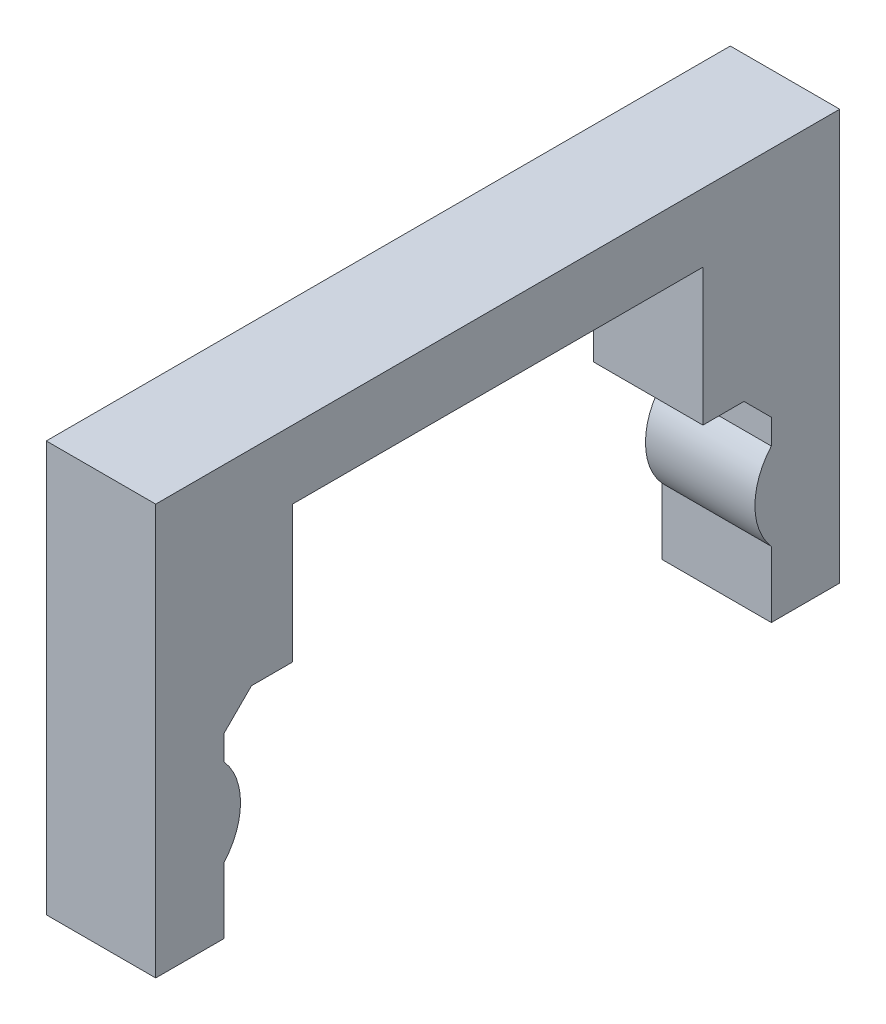
ISO-10303-21;
HEADER;
FILE_DESCRIPTION(('STEP AP214'),'2;1');
FILE_NAME('part.step','',(''),(''),'','','');
FILE_SCHEMA(('AUTOMOTIVE_DESIGN { 1 0 10303 214 1 1 1 1 }'));
ENDSEC;
DATA;
#1=APPLICATION_CONTEXT('core data for automotive mechanical design processes');
#2=APPLICATION_PROTOCOL_DEFINITION('international standard','automotive_design',2000,#1);
#3=PRODUCT_CONTEXT('',#1,'mechanical');
#4=PRODUCT('Part','Part','',(#3));
#5=PRODUCT_RELATED_PRODUCT_CATEGORY('part','',(#4));
#6=PRODUCT_DEFINITION_FORMATION('','',#4);
#7=PRODUCT_DEFINITION_CONTEXT('part definition',#1,'design');
#8=PRODUCT_DEFINITION('design','',#6,#7);
#9=PRODUCT_DEFINITION_SHAPE('','',#8);
#10=(LENGTH_UNIT() NAMED_UNIT(*) SI_UNIT(.MILLI.,.METRE.));
#11=(NAMED_UNIT(*) PLANE_ANGLE_UNIT() SI_UNIT($,.RADIAN.));
#12=(NAMED_UNIT(*) SI_UNIT($,.STERADIAN.) SOLID_ANGLE_UNIT());
#13=UNCERTAINTY_MEASURE_WITH_UNIT(LENGTH_MEASURE(1.E-05),#10,'distance_accuracy_value','');
#14=(GEOMETRIC_REPRESENTATION_CONTEXT(3) GLOBAL_UNCERTAINTY_ASSIGNED_CONTEXT((#13)) GLOBAL_UNIT_ASSIGNED_CONTEXT((#10,
#11,#12)) REPRESENTATION_CONTEXT('',''));
#15=CARTESIAN_POINT('',(0.,0.,0.));
#16=DIRECTION('',(0.,0.,1.));
#17=DIRECTION('',(1.,0.,0.));
#18=AXIS2_PLACEMENT_3D('',#15,#16,#17);
#19=CARTESIAN_POINT('',(10.16,9.94734725305141,44.6955776659082));
#20=DIRECTION('',(0.,0.,-1.));
#21=DIRECTION('',(-1.,0.,0.));
#22=AXIS2_PLACEMENT_3D('',#19,#20,#21);
#23=PLANE('',#22);
#24=DIRECTION('',(0.,-1.,0.));
#25=VECTOR('',#24,1.);
#26=CARTESIAN_POINT('',(10.16,9.94734725305141,44.6955776659082));
#27=LINE('',#26,#25);
#28=CARTESIAN_POINT('',(10.16,7.4073472530514,44.6955776659082));
#29=VERTEX_POINT('',#28);
#30=CARTESIAN_POINT('',(10.16,5.08947225111384,44.6955776659082));
#31=VERTEX_POINT('',#30);
#32=EDGE_CURVE('E157',#29,#31,#27,.T.);
#33=ORIENTED_EDGE('',*,*,#32,.F.);
#34=DIRECTION('',(-1.,0.,0.));
#35=VECTOR('',#34,1.);
#36=CARTESIAN_POINT('',(0.,7.4073472530514,44.6955776659082));
#37=LINE('',#36,#35);
#38=CARTESIAN_POINT('',(0.,7.4073472530514,44.6955776659082));
#39=VERTEX_POINT('',#38);
#40=EDGE_CURVE('E278',#29,#39,#37,.T.);
#41=ORIENTED_EDGE('',*,*,#40,.T.);
#42=DIRECTION('',(0.,-1.,0.));
#43=VECTOR('',#42,1.);
#44=CARTESIAN_POINT('',(0.,9.94734725305141,44.6955776659082));
#45=LINE('',#44,#43);
#46=CARTESIAN_POINT('',(0.,5.08947225111384,44.6955776659082));
#47=VERTEX_POINT('',#46);
#48=EDGE_CURVE('E180',#39,#47,#45,.T.);
#49=ORIENTED_EDGE('',*,*,#48,.T.);
#50=DIRECTION('',(1.,0.,0.));
#51=VECTOR('',#50,1.);
#52=CARTESIAN_POINT('',(0.,5.08947225111384,44.6955776659082));
#53=LINE('',#52,#51);
#54=EDGE_CURVE('E173',#47,#31,#53,.T.);
#55=ORIENTED_EDGE('',*,*,#54,.T.);
#56=EDGE_LOOP('',(#33,#41,#49,#55));
#57=FACE_BOUND('',#56,.T.);
#58=ADVANCED_FACE('F33',(#57),#23,.F.);
#59=CARTESIAN_POINT('',(10.16,-9.1026527469486,95.4955776659082));
#60=DIRECTION('',(0.,0.,1.));
#61=DIRECTION('',(1.,0.,0.));
#62=AXIS2_PLACEMENT_3D('',#59,#60,#61);
#63=PLANE('',#62);
#64=DIRECTION('',(0.,1.,0.));
#65=VECTOR('',#64,1.);
#66=CARTESIAN_POINT('',(0.,-9.1026527469486,95.4955776659082));
#67=LINE('',#66,#65);
#68=CARTESIAN_POINT('',(0.,-9.1026527469486,95.4955776659082));
#69=VERTEX_POINT('',#68);
#70=CARTESIAN_POINT('',(0.,-2.97477774501105,95.4955776659082));
#71=VERTEX_POINT('',#70);
#72=EDGE_CURVE('E224',#69,#71,#67,.T.);
#73=ORIENTED_EDGE('',*,*,#72,.T.);
#74=DIRECTION('',(1.,0.,0.));
#75=VECTOR('',#74,1.);
#76=CARTESIAN_POINT('',(0.,-2.97477774501105,95.4955776659082));
#77=LINE('',#76,#75);
#78=CARTESIAN_POINT('',(10.16,-2.97477774501105,95.4955776659082));
#79=VERTEX_POINT('',#78);
#80=EDGE_CURVE('E191',#71,#79,#77,.T.);
#81=ORIENTED_EDGE('',*,*,#80,.T.);
#82=DIRECTION('',(0.,1.,0.));
#83=VECTOR('',#82,1.);
#84=CARTESIAN_POINT('',(10.16,-9.1026527469486,95.4955776659082));
#85=LINE('',#84,#83);
#86=CARTESIAN_POINT('',(10.16,-9.1026527469486,95.4955776659082));
#87=VERTEX_POINT('',#86);
#88=EDGE_CURVE('E201',#87,#79,#85,.T.);
#89=ORIENTED_EDGE('',*,*,#88,.F.);
#90=DIRECTION('',(-1.,0.,0.));
#91=VECTOR('',#90,1.);
#92=CARTESIAN_POINT('',(10.16,-9.1026527469486,95.4955776659082));
#93=LINE('',#92,#91);
#94=EDGE_CURVE('E267',#87,#69,#93,.T.);
#95=ORIENTED_EDGE('',*,*,#94,.T.);
#96=EDGE_LOOP('',(#73,#81,#89,#95));
#97=FACE_BOUND('',#96,.T.);
#98=ADVANCED_FACE('F311',(#97),#63,.F.);
#99=CARTESIAN_POINT('',(10.16,28.9973472530514,101.845577665908));
#100=DIRECTION('',(0.,0.,-1.));
#101=DIRECTION('',(-1.,0.,0.));
#102=AXIS2_PLACEMENT_3D('',#99,#100,#101);
#103=PLANE('',#102);
#104=DIRECTION('',(-1.,0.,0.));
#105=VECTOR('',#104,1.);
#106=CARTESIAN_POINT('',(10.16,-9.1026527469486,101.845577665908));
#107=LINE('',#106,#105);
#108=CARTESIAN_POINT('',(10.16,-9.1026527469486,101.845577665908));
#109=VERTEX_POINT('',#108);
#110=CARTESIAN_POINT('',(0.,-9.1026527469486,101.845577665908));
#111=VERTEX_POINT('',#110);
#112=EDGE_CURVE('E270',#109,#111,#107,.T.);
#113=ORIENTED_EDGE('',*,*,#112,.F.);
#114=DIRECTION('',(0.,-1.,0.));
#115=VECTOR('',#114,1.);
#116=CARTESIAN_POINT('',(10.16,28.9973472530514,101.845577665908));
#117=LINE('',#116,#115);
#118=CARTESIAN_POINT('',(10.16,28.9973472530514,101.845577665908));
#119=VERTEX_POINT('',#118);
#120=EDGE_CURVE('E195',#119,#109,#117,.T.);
#121=ORIENTED_EDGE('',*,*,#120,.F.);
#122=DIRECTION('',(-1.,0.,0.));
#123=VECTOR('',#122,1.);
#124=CARTESIAN_POINT('',(10.16,28.9973472530514,101.845577665908));
#125=LINE('',#124,#123);
#126=CARTESIAN_POINT('',(0.,28.9973472530514,101.845577665908));
#127=VERTEX_POINT('',#126);
#128=EDGE_CURVE('E219',#119,#127,#125,.T.);
#129=ORIENTED_EDGE('',*,*,#128,.T.);
#130=DIRECTION('',(0.,-1.,0.));
#131=VECTOR('',#130,1.);
#132=CARTESIAN_POINT('',(0.,28.9973472530514,101.845577665908));
#133=LINE('',#132,#131);
#134=EDGE_CURVE('E194',#127,#111,#133,.T.);
#135=ORIENTED_EDGE('',*,*,#134,.T.);
#136=EDGE_LOOP('',(#113,#121,#129,#135));
#137=FACE_BOUND('',#136,.T.);
#138=ADVANCED_FACE('F322',(#137),#103,.F.);
#139=CARTESIAN_POINT('',(10.16,-9.1026527469486,101.845577665908));
#140=DIRECTION('',(0.,1.,0.));
#141=DIRECTION('',(0.,0.,1.));
#142=AXIS2_PLACEMENT_3D('',#139,#140,#141);
#143=PLANE('',#142);
#144=DIRECTION('',(0.,0.,-1.));
#145=VECTOR('',#144,1.);
#146=CARTESIAN_POINT('',(0.,-9.1026527469486,101.845577665908));
#147=LINE('',#146,#145);
#148=EDGE_CURVE('E221',#111,#69,#147,.T.);
#149=ORIENTED_EDGE('',*,*,#148,.T.);
#150=ORIENTED_EDGE('',*,*,#94,.F.);
#151=DIRECTION('',(0.,0.,-1.));
#152=VECTOR('',#151,1.);
#153=CARTESIAN_POINT('',(10.16,-9.1026527469486,101.845577665908));
#154=LINE('',#153,#152);
#155=EDGE_CURVE('E197',#109,#87,#154,.T.);
#156=ORIENTED_EDGE('',*,*,#155,.F.);
#157=ORIENTED_EDGE('',*,*,#112,.T.);
#158=EDGE_LOOP('',(#149,#150,#156,#157));
#159=FACE_BOUND('',#158,.T.);
#160=ADVANCED_FACE('F316',(#159),#143,.F.);
#161=CARTESIAN_POINT('',(0.,5.08947225111387,95.4955776659082));
#162=VERTEX_POINT('',#161);
#163=CARTESIAN_POINT('',(0.,7.4073472530514,95.4955776659082));
#164=VERTEX_POINT('',#163);
#165=EDGE_CURVE('E223',#162,#164,#67,.T.);
#166=ORIENTED_EDGE('',*,*,#165,.T.);
#167=DIRECTION('',(1.,0.,0.));
#168=VECTOR('',#167,1.);
#169=CARTESIAN_POINT('',(10.16,7.4073472530514,95.4955776659082));
#170=LINE('',#169,#168);
#171=CARTESIAN_POINT('',(10.16,7.4073472530514,95.4955776659082));
#172=VERTEX_POINT('',#171);
#173=EDGE_CURVE('E276',#164,#172,#170,.T.);
#174=ORIENTED_EDGE('',*,*,#173,.T.);
#175=CARTESIAN_POINT('',(10.16,5.08947225111387,95.4955776659082));
#176=VERTEX_POINT('',#175);
#177=EDGE_CURVE('E200',#176,#172,#85,.T.);
#178=ORIENTED_EDGE('',*,*,#177,.F.);
#179=DIRECTION('',(1.,0.,0.));
#180=VECTOR('',#179,1.);
#181=CARTESIAN_POINT('',(0.,5.08947225111387,95.4955776659082));
#182=LINE('',#181,#180);
#183=EDGE_CURVE('E187',#176,#162,#182,.F.);
#184=ORIENTED_EDGE('',*,*,#183,.T.);
#185=EDGE_LOOP('',(#166,#174,#178,#184));
#186=FACE_BOUND('',#185,.T.);
#187=ADVANCED_FACE('F304',(#186),#63,.F.);
#188=CARTESIAN_POINT('',(10.16,9.94734725305141,95.4955776659082));
#189=DIRECTION('',(0.,1.,0.));
#190=DIRECTION('',(0.,0.,1.));
#191=AXIS2_PLACEMENT_3D('',#188,#189,#190);
#192=PLANE('',#191);
#193=DIRECTION('',(0.,0.,-1.));
#194=VECTOR('',#193,1.);
#195=CARTESIAN_POINT('',(10.16,9.94734725305141,95.4955776659082));
#196=LINE('',#195,#194);
#197=CARTESIAN_POINT('',(10.16,9.94734725305141,92.9555776659082));
#198=VERTEX_POINT('',#197);
#199=CARTESIAN_POINT('',(10.16,9.94734725305141,89.1455776659082));
#200=VERTEX_POINT('',#199);
#201=EDGE_CURVE('E204',#198,#200,#196,.T.);
#202=ORIENTED_EDGE('',*,*,#201,.F.);
#203=DIRECTION('',(-1.,0.,0.));
#204=VECTOR('',#203,1.);
#205=CARTESIAN_POINT('',(0.,9.94734725305141,92.9555776659082));
#206=LINE('',#205,#204);
#207=CARTESIAN_POINT('',(0.,9.94734725305141,92.9555776659082));
#208=VERTEX_POINT('',#207);
#209=EDGE_CURVE('E273',#198,#208,#206,.T.);
#210=ORIENTED_EDGE('',*,*,#209,.T.);
#211=DIRECTION('',(0.,0.,-1.));
#212=VECTOR('',#211,1.);
#213=CARTESIAN_POINT('',(0.,9.94734725305141,95.4955776659082));
#214=LINE('',#213,#212);
#215=CARTESIAN_POINT('',(0.,9.94734725305141,89.1455776659082));
#216=VERTEX_POINT('',#215);
#217=EDGE_CURVE('E227',#208,#216,#214,.T.);
#218=ORIENTED_EDGE('',*,*,#217,.T.);
#219=DIRECTION('',(-1.,0.,0.));
#220=VECTOR('',#219,1.);
#221=CARTESIAN_POINT('',(10.16,9.94734725305141,89.1455776659082));
#222=LINE('',#221,#220);
#223=EDGE_CURVE('E264',#200,#216,#222,.T.);
#224=ORIENTED_EDGE('',*,*,#223,.F.);
#225=EDGE_LOOP('',(#202,#210,#218,#224));
#226=FACE_BOUND('',#225,.T.);
#227=ADVANCED_FACE('F293',(#226),#192,.F.);
#228=CARTESIAN_POINT('',(10.16,9.94734725305141,89.1455776659082));
#229=DIRECTION('',(0.,0.,1.));
#230=DIRECTION('',(1.,0.,0.));
#231=AXIS2_PLACEMENT_3D('',#228,#229,#230);
#232=PLANE('',#231);
#233=DIRECTION('',(0.,1.,0.));
#234=VECTOR('',#233,1.);
#235=CARTESIAN_POINT('',(0.,9.94734725305141,89.1455776659082));
#236=LINE('',#235,#234);
#237=CARTESIAN_POINT('',(0.,22.6473472530514,89.1455776659082));
#238=VERTEX_POINT('',#237);
#239=EDGE_CURVE('E229',#216,#238,#236,.T.);
#240=ORIENTED_EDGE('',*,*,#239,.T.);
#241=DIRECTION('',(-1.,0.,0.));
#242=VECTOR('',#241,1.);
#243=CARTESIAN_POINT('',(10.16,22.6473472530514,89.1455776659082));
#244=LINE('',#243,#242);
#245=CARTESIAN_POINT('',(10.16,22.6473472530514,89.1455776659082));
#246=VERTEX_POINT('',#245);
#247=EDGE_CURVE('E261',#246,#238,#244,.T.);
#248=ORIENTED_EDGE('',*,*,#247,.F.);
#249=DIRECTION('',(0.,1.,0.));
#250=VECTOR('',#249,1.);
#251=CARTESIAN_POINT('',(10.16,9.94734725305141,89.1455776659082));
#252=LINE('',#251,#250);
#253=EDGE_CURVE('E206',#200,#246,#252,.T.);
#254=ORIENTED_EDGE('',*,*,#253,.F.);
#255=ORIENTED_EDGE('',*,*,#223,.T.);
#256=EDGE_LOOP('',(#240,#248,#254,#255));
#257=FACE_BOUND('',#256,.T.);
#258=ADVANCED_FACE('F366',(#257),#232,.F.);
#259=CARTESIAN_POINT('',(10.16,22.6473472530514,89.1455776659082));
#260=DIRECTION('',(0.,1.,0.));
#261=DIRECTION('',(0.,0.,1.));
#262=AXIS2_PLACEMENT_3D('',#259,#260,#261);
#263=PLANE('',#262);
#264=DIRECTION('',(0.,0.,-1.));
#265=VECTOR('',#264,1.);
#266=CARTESIAN_POINT('',(0.,22.6473472530514,89.1455776659082));
#267=LINE('',#266,#265);
#268=CARTESIAN_POINT('',(0.,22.6473472530514,51.0455776659082));
#269=VERTEX_POINT('',#268);
#270=EDGE_CURVE('E231',#238,#269,#267,.T.);
#271=ORIENTED_EDGE('',*,*,#270,.T.);
#272=DIRECTION('',(-1.,0.,0.));
#273=VECTOR('',#272,1.);
#274=CARTESIAN_POINT('',(10.16,22.6473472530514,51.0455776659082));
#275=LINE('',#274,#273);
#276=CARTESIAN_POINT('',(10.16,22.6473472530514,51.0455776659082));
#277=VERTEX_POINT('',#276);
#278=EDGE_CURVE('E258',#277,#269,#275,.T.);
#279=ORIENTED_EDGE('',*,*,#278,.F.);
#280=DIRECTION('',(0.,0.,-1.));
#281=VECTOR('',#280,1.);
#282=CARTESIAN_POINT('',(10.16,22.6473472530514,89.1455776659082));
#283=LINE('',#282,#281);
#284=EDGE_CURVE('E208',#246,#277,#283,.T.);
#285=ORIENTED_EDGE('',*,*,#284,.F.);
#286=ORIENTED_EDGE('',*,*,#247,.T.);
#287=EDGE_LOOP('',(#271,#279,#285,#286));
#288=FACE_BOUND('',#287,.T.);
#289=ADVANCED_FACE('F448',(#288),#263,.F.);
#290=CARTESIAN_POINT('',(10.16,22.6473472530514,51.0455776659082));
#291=DIRECTION('',(0.,0.,-1.));
#292=DIRECTION('',(-1.,0.,0.));
#293=AXIS2_PLACEMENT_3D('',#290,#291,#292);
#294=PLANE('',#293);
#295=DIRECTION('',(0.,-1.,0.));
#296=VECTOR('',#295,1.);
#297=CARTESIAN_POINT('',(0.,22.6473472530514,51.0455776659082));
#298=LINE('',#297,#296);
#299=CARTESIAN_POINT('',(0.,9.94734725305141,51.0455776659082));
#300=VERTEX_POINT('',#299);
#301=EDGE_CURVE('E233',#269,#300,#298,.T.);
#302=ORIENTED_EDGE('',*,*,#301,.T.);
#303=DIRECTION('',(-1.,0.,0.));
#304=VECTOR('',#303,1.);
#305=CARTESIAN_POINT('',(10.16,9.94734725305141,51.0455776659082));
#306=LINE('',#305,#304);
#307=CARTESIAN_POINT('',(10.16,9.94734725305141,51.0455776659082));
#308=VERTEX_POINT('',#307);
#309=EDGE_CURVE('E255',#308,#300,#306,.T.);
#310=ORIENTED_EDGE('',*,*,#309,.F.);
#311=DIRECTION('',(0.,-1.,0.));
#312=VECTOR('',#311,1.);
#313=CARTESIAN_POINT('',(10.16,22.6473472530514,51.0455776659082));
#314=LINE('',#313,#312);
#315=EDGE_CURVE('E210',#277,#308,#314,.T.);
#316=ORIENTED_EDGE('',*,*,#315,.F.);
#317=ORIENTED_EDGE('',*,*,#278,.T.);
#318=EDGE_LOOP('',(#302,#310,#316,#317));
#319=FACE_BOUND('',#318,.T.);
#320=ADVANCED_FACE('F348',(#319),#294,.F.);
#321=CARTESIAN_POINT('',(10.16,9.94734725305141,51.0455776659082));
#322=DIRECTION('',(0.,1.,0.));
#323=DIRECTION('',(0.,0.,1.));
#324=AXIS2_PLACEMENT_3D('',#321,#322,#323);
#325=PLANE('',#324);
#326=DIRECTION('',(0.,0.,-1.));
#327=VECTOR('',#326,1.);
#328=CARTESIAN_POINT('',(0.,9.94734725305141,51.0455776659082));
#329=LINE('',#328,#327);
#330=CARTESIAN_POINT('',(0.,9.94734725305141,47.2355776659082));
#331=VERTEX_POINT('',#330);
#332=EDGE_CURVE('E235',#300,#331,#329,.T.);
#333=ORIENTED_EDGE('',*,*,#332,.T.);
#334=DIRECTION('',(1.,0.,0.));
#335=VECTOR('',#334,1.);
#336=CARTESIAN_POINT('',(10.16,9.94734725305141,47.2355776659082));
#337=LINE('',#336,#335);
#338=CARTESIAN_POINT('',(10.16,9.94734725305141,47.2355776659082));
#339=VERTEX_POINT('',#338);
#340=EDGE_CURVE('E48',#331,#339,#337,.T.);
#341=ORIENTED_EDGE('',*,*,#340,.T.);
#342=DIRECTION('',(0.,0.,-1.));
#343=VECTOR('',#342,1.);
#344=CARTESIAN_POINT('',(10.16,9.94734725305141,51.0455776659082));
#345=LINE('',#344,#343);
#346=EDGE_CURVE('E212',#308,#339,#345,.T.);
#347=ORIENTED_EDGE('',*,*,#346,.F.);
#348=ORIENTED_EDGE('',*,*,#309,.T.);
#349=EDGE_LOOP('',(#333,#341,#347,#348));
#350=FACE_BOUND('',#349,.T.);
#351=ADVANCED_FACE('F341',(#350),#325,.F.);
#352=CARTESIAN_POINT('',(10.16,-2.97477774501102,44.6955776659082));
#353=VERTEX_POINT('',#352);
#354=CARTESIAN_POINT('',(10.16,-9.1026527469486,44.6955776659082));
#355=VERTEX_POINT('',#354);
#356=EDGE_CURVE('E168',#353,#355,#27,.T.);
#357=ORIENTED_EDGE('',*,*,#356,.F.);
#358=DIRECTION('',(1.,0.,0.));
#359=VECTOR('',#358,1.);
#360=CARTESIAN_POINT('',(0.,-2.97477774501102,44.6955776659082));
#361=LINE('',#360,#359);
#362=CARTESIAN_POINT('',(0.,-2.97477774501102,44.6955776659082));
#363=VERTEX_POINT('',#362);
#364=EDGE_CURVE('E176',#353,#363,#361,.F.);
#365=ORIENTED_EDGE('',*,*,#364,.T.);
#366=CARTESIAN_POINT('',(0.,-9.1026527469486,44.6955776659082));
#367=VERTEX_POINT('',#366);
#368=EDGE_CURVE('E237',#363,#367,#45,.T.);
#369=ORIENTED_EDGE('',*,*,#368,.T.);
#370=DIRECTION('',(-1.,0.,0.));
#371=VECTOR('',#370,1.);
#372=CARTESIAN_POINT('',(10.16,-9.1026527469486,44.6955776659082));
#373=LINE('',#372,#371);
#374=EDGE_CURVE('E252',#355,#367,#373,.T.);
#375=ORIENTED_EDGE('',*,*,#374,.F.);
#376=EDGE_LOOP('',(#357,#365,#369,#375));
#377=FACE_BOUND('',#376,.T.);
#378=ADVANCED_FACE('F339',(#377),#23,.F.);
#379=CARTESIAN_POINT('',(10.16,-9.1026527469486,44.6955776659082));
#380=DIRECTION('',(0.,1.,0.));
#381=DIRECTION('',(0.,0.,1.));
#382=AXIS2_PLACEMENT_3D('',#379,#380,#381);
#383=PLANE('',#382);
#384=DIRECTION('',(0.,0.,-1.));
#385=VECTOR('',#384,1.);
#386=CARTESIAN_POINT('',(0.,-9.1026527469486,44.6955776659082));
#387=LINE('',#386,#385);
#388=CARTESIAN_POINT('',(0.,-9.1026527469486,38.3455776659082));
#389=VERTEX_POINT('',#388);
#390=EDGE_CURVE('E239',#367,#389,#387,.T.);
#391=ORIENTED_EDGE('',*,*,#390,.T.);
#392=DIRECTION('',(-1.,0.,0.));
#393=VECTOR('',#392,1.);
#394=CARTESIAN_POINT('',(10.16,-9.1026527469486,38.3455776659082));
#395=LINE('',#394,#393);
#396=CARTESIAN_POINT('',(10.16,-9.1026527469486,38.3455776659082));
#397=VERTEX_POINT('',#396);
#398=EDGE_CURVE('E249',#397,#389,#395,.T.);
#399=ORIENTED_EDGE('',*,*,#398,.F.);
#400=DIRECTION('',(0.,0.,-1.));
#401=VECTOR('',#400,1.);
#402=CARTESIAN_POINT('',(10.16,-9.1026527469486,44.6955776659082));
#403=LINE('',#402,#401);
#404=EDGE_CURVE('E167',#355,#397,#403,.T.);
#405=ORIENTED_EDGE('',*,*,#404,.F.);
#406=ORIENTED_EDGE('',*,*,#374,.T.);
#407=EDGE_LOOP('',(#391,#399,#405,#406));
#408=FACE_BOUND('',#407,.T.);
#409=ADVANCED_FACE('F335',(#408),#383,.F.);
#410=CARTESIAN_POINT('',(10.16,-9.1026527469486,38.3455776659082));
#411=DIRECTION('',(0.,0.,1.));
#412=DIRECTION('',(1.,0.,0.));
#413=AXIS2_PLACEMENT_3D('',#410,#411,#412);
#414=PLANE('',#413);
#415=DIRECTION('',(-1.,0.,0.));
#416=VECTOR('',#415,1.);
#417=CARTESIAN_POINT('',(10.16,28.9973472530514,38.3455776659082));
#418=LINE('',#417,#416);
#419=CARTESIAN_POINT('',(10.16,28.9973472530514,38.3455776659082));
#420=VERTEX_POINT('',#419);
#421=CARTESIAN_POINT('',(0.,28.9973472530514,38.3455776659082));
#422=VERTEX_POINT('',#421);
#423=EDGE_CURVE('E246',#420,#422,#418,.T.);
#424=ORIENTED_EDGE('',*,*,#423,.F.);
#425=DIRECTION('',(0.,1.,0.));
#426=VECTOR('',#425,1.);
#427=CARTESIAN_POINT('',(10.16,-9.1026527469486,38.3455776659082));
#428=LINE('',#427,#426);
#429=EDGE_CURVE('E215',#397,#420,#428,.T.);
#430=ORIENTED_EDGE('',*,*,#429,.F.);
#431=ORIENTED_EDGE('',*,*,#398,.T.);
#432=DIRECTION('',(0.,1.,0.));
#433=VECTOR('',#432,1.);
#434=CARTESIAN_POINT('',(0.,-9.1026527469486,38.3455776659082));
#435=LINE('',#434,#433);
#436=EDGE_CURVE('E241',#389,#422,#435,.T.);
#437=ORIENTED_EDGE('',*,*,#436,.T.);
#438=EDGE_LOOP('',(#424,#430,#431,#437));
#439=FACE_BOUND('',#438,.T.);
#440=ADVANCED_FACE('F331',(#439),#414,.F.);
#441=CARTESIAN_POINT('',(10.16,28.9973472530514,38.3455776659082));
#442=DIRECTION('',(0.,-1.,0.));
#443=DIRECTION('',(0.,0.,-1.));
#444=AXIS2_PLACEMENT_3D('',#441,#442,#443);
#445=PLANE('',#444);
#446=DIRECTION('',(0.,0.,1.));
#447=VECTOR('',#446,1.);
#448=CARTESIAN_POINT('',(0.,28.9973472530514,38.3455776659082));
#449=LINE('',#448,#447);
#450=EDGE_CURVE('E198',#422,#127,#449,.T.);
#451=ORIENTED_EDGE('',*,*,#450,.T.);
#452=ORIENTED_EDGE('',*,*,#128,.F.);
#453=DIRECTION('',(0.,0.,1.));
#454=VECTOR('',#453,1.);
#455=CARTESIAN_POINT('',(10.16,28.9973472530514,38.3455776659082));
#456=LINE('',#455,#454);
#457=EDGE_CURVE('E217',#420,#119,#456,.T.);
#458=ORIENTED_EDGE('',*,*,#457,.F.);
#459=ORIENTED_EDGE('',*,*,#423,.T.);
#460=EDGE_LOOP('',(#451,#452,#458,#459));
#461=FACE_BOUND('',#460,.T.);
#462=ADVANCED_FACE('F327',(#461),#445,.F.);
#463=CARTESIAN_POINT('',(10.16,-9.1026527469486,101.845577665908));
#464=DIRECTION('',(1.,0.,0.));
#465=DIRECTION('',(0.,0.,-1.));
#466=AXIS2_PLACEMENT_3D('',#463,#464,#465);
#467=PLANE('',#466);
#468=ORIENTED_EDGE('',*,*,#429,.T.);
#469=ORIENTED_EDGE('',*,*,#457,.T.);
#470=ORIENTED_EDGE('',*,*,#120,.T.);
#471=ORIENTED_EDGE('',*,*,#155,.T.);
#472=ORIENTED_EDGE('',*,*,#88,.T.);
#473=CARTESIAN_POINT('',(10.16,1.05734725305141,100.067577665908));
#474=DIRECTION('',(1.,0.,0.));
#475=DIRECTION('',(0.,0.,-1.));
#476=AXIS2_PLACEMENT_3D('',#473,#474,#475);
#477=CIRCLE('',#476,6.09600000000001);
#478=EDGE_CURVE('E181',#79,#176,#477,.T.);
#479=ORIENTED_EDGE('',*,*,#478,.T.);
#480=ORIENTED_EDGE('',*,*,#177,.T.);
#481=DIRECTION('',(0.,-0.707106781186543,0.707106781186552));
#482=VECTOR('',#481,1.);
#483=CARTESIAN_POINT('',(10.16,9.94734725305141,92.9555776659082));
#484=LINE('',#483,#482);
#485=EDGE_CURVE('E283',#172,#198,#484,.F.);
#486=ORIENTED_EDGE('',*,*,#485,.T.);
#487=ORIENTED_EDGE('',*,*,#201,.T.);
#488=ORIENTED_EDGE('',*,*,#253,.T.);
#489=ORIENTED_EDGE('',*,*,#284,.T.);
#490=ORIENTED_EDGE('',*,*,#315,.T.);
#491=ORIENTED_EDGE('',*,*,#346,.T.);
#492=DIRECTION('',(0.,0.707106781186551,0.707106781186544));
#493=VECTOR('',#492,1.);
#494=CARTESIAN_POINT('',(10.16,7.4073472530514,44.6955776659082));
#495=LINE('',#494,#493);
#496=EDGE_CURVE('E11',#339,#29,#495,.F.);
#497=ORIENTED_EDGE('',*,*,#496,.T.);
#498=ORIENTED_EDGE('',*,*,#32,.T.);
#499=CARTESIAN_POINT('',(10.16,1.05734725305141,40.1235776659082));
#500=DIRECTION('',(1.,0.,0.));
#501=DIRECTION('',(0.,0.,-1.));
#502=AXIS2_PLACEMENT_3D('',#499,#500,#501);
#503=CIRCLE('',#502,6.096);
#504=EDGE_CURVE('E160',#31,#353,#503,.T.);
#505=ORIENTED_EDGE('',*,*,#504,.T.);
#506=ORIENTED_EDGE('',*,*,#356,.T.);
#507=ORIENTED_EDGE('',*,*,#404,.T.);
#508=EDGE_LOOP('',(#468,#469,#470,#471,#472,#479,#480,#486,#487,#488,#489,#490,#491,#497,#498,
#505,#506,#507));
#509=FACE_BOUND('',#508,.T.);
#510=ADVANCED_FACE('F159',(#509),#467,.T.);
#511=CARTESIAN_POINT('',(0.,-9.1026527469486,101.845577665908));
#512=DIRECTION('',(1.,0.,0.));
#513=DIRECTION('',(0.,0.,-1.));
#514=AXIS2_PLACEMENT_3D('',#511,#512,#513);
#515=PLANE('',#514);
#516=ORIENTED_EDGE('',*,*,#368,.F.);
#517=CARTESIAN_POINT('',(0.,1.05734725305141,40.1235776659082));
#518=DIRECTION('',(1.,0.,0.));
#519=DIRECTION('',(0.,0.,-1.));
#520=AXIS2_PLACEMENT_3D('',#517,#518,#519);
#521=CIRCLE('',#520,6.096);
#522=EDGE_CURVE('E178',#47,#363,#521,.T.);
#523=ORIENTED_EDGE('',*,*,#522,.F.);
#524=ORIENTED_EDGE('',*,*,#48,.F.);
#525=DIRECTION('',(0.,-0.707106781186551,-0.707106781186544));
#526=VECTOR('',#525,1.);
#527=CARTESIAN_POINT('',(0.,27.7273472530513,65.0155776659079));
#528=LINE('',#527,#526);
#529=EDGE_CURVE('E41',#39,#331,#528,.F.);
#530=ORIENTED_EDGE('',*,*,#529,.T.);
#531=ORIENTED_EDGE('',*,*,#332,.F.);
#532=ORIENTED_EDGE('',*,*,#301,.F.);
#533=ORIENTED_EDGE('',*,*,#270,.F.);
#534=ORIENTED_EDGE('',*,*,#239,.F.);
#535=ORIENTED_EDGE('',*,*,#217,.F.);
#536=DIRECTION('',(0.,0.707106781186543,-0.707106781186552));
#537=VECTOR('',#536,1.);
#538=CARTESIAN_POINT('',(0.,-4.02265274694849,106.925577665908));
#539=LINE('',#538,#537);
#540=EDGE_CURVE('E281',#208,#164,#539,.F.);
#541=ORIENTED_EDGE('',*,*,#540,.T.);
#542=ORIENTED_EDGE('',*,*,#165,.F.);
#543=CARTESIAN_POINT('',(0.,1.05734725305141,100.067577665908));
#544=DIRECTION('',(1.,0.,0.));
#545=DIRECTION('',(0.,0.,-1.));
#546=AXIS2_PLACEMENT_3D('',#543,#544,#545);
#547=CIRCLE('',#546,6.09600000000001);
#548=EDGE_CURVE('E183',#71,#162,#547,.T.);
#549=ORIENTED_EDGE('',*,*,#548,.F.);
#550=ORIENTED_EDGE('',*,*,#72,.F.);
#551=ORIENTED_EDGE('',*,*,#148,.F.);
#552=ORIENTED_EDGE('',*,*,#134,.F.);
#553=ORIENTED_EDGE('',*,*,#450,.F.);
#554=ORIENTED_EDGE('',*,*,#436,.F.);
#555=ORIENTED_EDGE('',*,*,#390,.F.);
#556=EDGE_LOOP('',(#516,#523,#524,#530,#531,#532,#533,#534,#535,#541,#542,#549,#550,#551,#552,
#553,#554,#555));
#557=FACE_BOUND('',#556,.T.);
#558=ADVANCED_FACE('F300',(#557),#515,.F.);
#559=CARTESIAN_POINT('',(0.,1.05734725305141,100.067577665908));
#560=DIRECTION('',(1.,0.,0.));
#561=DIRECTION('',(0.,0.,-1.));
#562=AXIS2_PLACEMENT_3D('',#559,#560,#561);
#563=CYLINDRICAL_SURFACE('',#562,6.09600000000001);
#564=ORIENTED_EDGE('',*,*,#80,.F.);
#565=ORIENTED_EDGE('',*,*,#548,.T.);
#566=ORIENTED_EDGE('',*,*,#183,.F.);
#567=ORIENTED_EDGE('',*,*,#478,.F.);
#568=EDGE_LOOP('',(#564,#565,#566,#567));
#569=FACE_BOUND('',#568,.T.);
#570=ADVANCED_FACE('F307',(#569),#563,.T.);
#571=CARTESIAN_POINT('',(0.,1.05734725305141,40.1235776659082));
#572=DIRECTION('',(1.,0.,0.));
#573=DIRECTION('',(0.,0.,-1.));
#574=AXIS2_PLACEMENT_3D('',#571,#572,#573);
#575=CYLINDRICAL_SURFACE('',#574,6.096);
#576=ORIENTED_EDGE('',*,*,#54,.F.);
#577=ORIENTED_EDGE('',*,*,#522,.T.);
#578=ORIENTED_EDGE('',*,*,#364,.F.);
#579=ORIENTED_EDGE('',*,*,#504,.F.);
#580=EDGE_LOOP('',(#576,#577,#578,#579));
#581=FACE_BOUND('',#580,.T.);
#582=ADVANCED_FACE('F172',(#581),#575,.T.);
#583=CARTESIAN_POINT('',(10.16,9.94734725305141,92.9555776659082));
#584=DIRECTION('',(0.,-0.707106781186552,-0.707106781186543));
#585=DIRECTION('',(0.,0.707106781186543,-0.707106781186552));
#586=AXIS2_PLACEMENT_3D('',#583,#584,#585);
#587=PLANE('',#586);
#588=ORIENTED_EDGE('',*,*,#485,.F.);
#589=ORIENTED_EDGE('',*,*,#173,.F.);
#590=ORIENTED_EDGE('',*,*,#540,.F.);
#591=ORIENTED_EDGE('',*,*,#209,.F.);
#592=EDGE_LOOP('',(#588,#589,#590,#591));
#593=FACE_BOUND('',#592,.T.);
#594=ADVANCED_FACE('F296',(#593),#587,.T.);
#595=CARTESIAN_POINT('',(10.16,7.4073472530514,44.6955776659082));
#596=DIRECTION('',(0.,-0.707106781186544,0.707106781186551));
#597=DIRECTION('',(0.,-0.707106781186551,-0.707106781186544));
#598=AXIS2_PLACEMENT_3D('',#595,#596,#597);
#599=PLANE('',#598);
#600=ORIENTED_EDGE('',*,*,#496,.F.);
#601=ORIENTED_EDGE('',*,*,#340,.F.);
#602=ORIENTED_EDGE('',*,*,#529,.F.);
#603=ORIENTED_EDGE('',*,*,#40,.F.);
#604=EDGE_LOOP('',(#600,#601,#602,#603));
#605=FACE_BOUND('',#604,.T.);
#606=ADVANCED_FACE('F35',(#605),#599,.T.);
#607=CLOSED_SHELL('',(#58,#98,#138,#160,#187,#227,#258,#289,#320,#351,#378,#409,#440,#462,#510,
#558,#570,#582,#594,#606));
#608=MANIFOLD_SOLID_BREP('B2',#607);
#609=ADVANCED_BREP_SHAPE_REPRESENTATION('',(#18,#608),#14);
#610=SHAPE_DEFINITION_REPRESENTATION(#9,#609);
ENDSEC;
END-ISO-10303-21;
